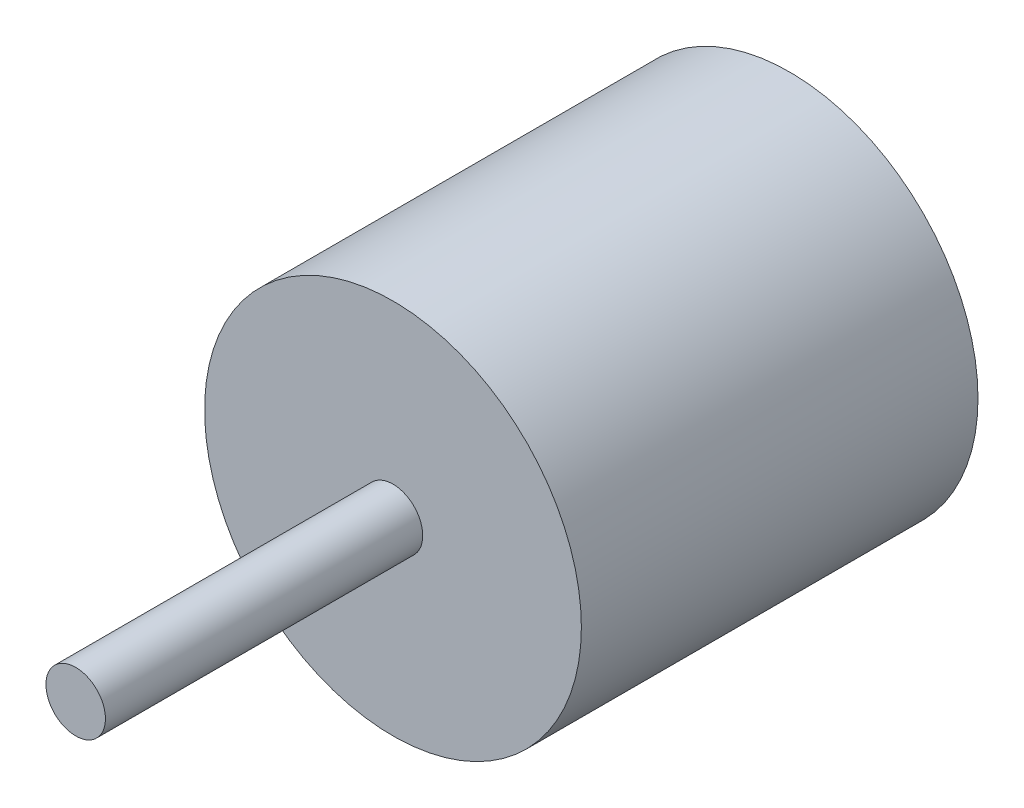
ISO-10303-21;
HEADER;
FILE_DESCRIPTION(('STEP AP214'),'2;1');
FILE_NAME('part.step','',(''),(''),'','','');
FILE_SCHEMA(('AUTOMOTIVE_DESIGN { 1 0 10303 214 1 1 1 1 }'));
ENDSEC;
DATA;
#1=APPLICATION_CONTEXT('core data for automotive mechanical design processes');
#2=APPLICATION_PROTOCOL_DEFINITION('international standard','automotive_design',2000,#1);
#3=PRODUCT_CONTEXT('',#1,'mechanical');
#4=PRODUCT('Part','Part','',(#3));
#5=PRODUCT_RELATED_PRODUCT_CATEGORY('part','',(#4));
#6=PRODUCT_DEFINITION_FORMATION('','',#4);
#7=PRODUCT_DEFINITION_CONTEXT('part definition',#1,'design');
#8=PRODUCT_DEFINITION('design','',#6,#7);
#9=PRODUCT_DEFINITION_SHAPE('','',#8);
#10=(LENGTH_UNIT() NAMED_UNIT(*) SI_UNIT(.MILLI.,.METRE.));
#11=(NAMED_UNIT(*) PLANE_ANGLE_UNIT() SI_UNIT($,.RADIAN.));
#12=(NAMED_UNIT(*) SI_UNIT($,.STERADIAN.) SOLID_ANGLE_UNIT());
#13=UNCERTAINTY_MEASURE_WITH_UNIT(LENGTH_MEASURE(1.E-05),#10,'distance_accuracy_value','');
#14=(GEOMETRIC_REPRESENTATION_CONTEXT(3) GLOBAL_UNCERTAINTY_ASSIGNED_CONTEXT((#13)) GLOBAL_UNIT_ASSIGNED_CONTEXT((#10,
#11,#12)) REPRESENTATION_CONTEXT('',''));
#15=CARTESIAN_POINT('',(0.,0.,0.));
#16=DIRECTION('',(0.,0.,1.));
#17=DIRECTION('',(1.,0.,0.));
#18=AXIS2_PLACEMENT_3D('',#15,#16,#17);
#19=CARTESIAN_POINT('',(26.38722035816,15.3807861980718,40.));
#20=DIRECTION('',(0.,0.,-1.));
#21=DIRECTION('',(-1.,0.,0.));
#22=AXIS2_PLACEMENT_3D('',#19,#20,#21);
#23=CYLINDRICAL_SURFACE('',#22,19.);
#24=CARTESIAN_POINT('',(26.38722035816,15.3807861980718,40.));
#25=DIRECTION('',(0.,0.,1.));
#26=DIRECTION('',(1.,0.,0.));
#27=AXIS2_PLACEMENT_3D('',#24,#25,#26);
#28=CIRCLE('',#27,19.);
#29=CARTESIAN_POINT('',(45.38722035816,15.3807861980718,40.));
#30=VERTEX_POINT('',#29);
#31=EDGE_CURVE('E45',#30,#30,#28,.T.);
#32=ORIENTED_EDGE('',*,*,#31,.F.);
#33=EDGE_LOOP('',(#32));
#34=FACE_BOUND('',#33,.T.);
#35=CARTESIAN_POINT('',(26.38722035816,15.3807861980718,0.));
#36=DIRECTION('',(0.,0.,1.));
#37=DIRECTION('',(1.,0.,0.));
#38=AXIS2_PLACEMENT_3D('',#35,#36,#37);
#39=CIRCLE('',#38,19.);
#40=CARTESIAN_POINT('',(45.38722035816,15.3807861980718,0.));
#41=VERTEX_POINT('',#40);
#42=EDGE_CURVE('E41',#41,#41,#39,.T.);
#43=ORIENTED_EDGE('',*,*,#42,.T.);
#44=EDGE_LOOP('',(#43));
#45=FACE_BOUND('',#44,.T.);
#46=ADVANCED_FACE('F38',(#34,#45),#23,.T.);
#47=CARTESIAN_POINT('',(26.38722035816,15.3807861980718,40.));
#48=DIRECTION('',(0.,0.,1.));
#49=DIRECTION('',(1.,0.,0.));
#50=AXIS2_PLACEMENT_3D('',#47,#48,#49);
#51=PLANE('',#50);
#52=CARTESIAN_POINT('',(26.38722035816,15.3807861980718,40.));
#53=DIRECTION('',(0.,0.,1.));
#54=DIRECTION('',(1.,0.,0.));
#55=AXIS2_PLACEMENT_3D('',#52,#53,#54);
#56=CIRCLE('',#55,3.);
#57=CARTESIAN_POINT('',(29.38722035816,15.3807861980718,40.));
#58=VERTEX_POINT('',#57);
#59=EDGE_CURVE('E10',#58,#58,#56,.T.);
#60=ORIENTED_EDGE('',*,*,#59,.F.);
#61=EDGE_LOOP('',(#60));
#62=FACE_BOUND('',#61,.T.);
#63=ORIENTED_EDGE('',*,*,#31,.T.);
#64=EDGE_LOOP('',(#63));
#65=FACE_BOUND('',#64,.T.);
#66=ADVANCED_FACE('F62',(#62,#65),#51,.T.);
#67=CARTESIAN_POINT('',(26.38722035816,15.3807861980718,0.));
#68=DIRECTION('',(0.,0.,1.));
#69=DIRECTION('',(1.,0.,0.));
#70=AXIS2_PLACEMENT_3D('',#67,#68,#69);
#71=PLANE('',#70);
#72=ORIENTED_EDGE('',*,*,#42,.F.);
#73=EDGE_LOOP('',(#72));
#74=FACE_BOUND('',#73,.T.);
#75=ADVANCED_FACE('F59',(#74),#71,.F.);
#76=CARTESIAN_POINT('',(26.38722035816,15.3807861980718,72.));
#77=DIRECTION('',(0.,0.,-1.));
#78=DIRECTION('',(-1.,0.,0.));
#79=AXIS2_PLACEMENT_3D('',#76,#77,#78);
#80=CYLINDRICAL_SURFACE('',#79,3.);
#81=CARTESIAN_POINT('',(26.38722035816,15.3807861980718,72.));
#82=DIRECTION('',(0.,0.,1.));
#83=DIRECTION('',(1.,0.,0.));
#84=AXIS2_PLACEMENT_3D('',#81,#82,#83);
#85=CIRCLE('',#84,3.);
#86=CARTESIAN_POINT('',(29.38722035816,15.3807861980718,72.));
#87=VERTEX_POINT('',#86);
#88=EDGE_CURVE('E51',#87,#87,#85,.T.);
#89=ORIENTED_EDGE('',*,*,#88,.F.);
#90=EDGE_LOOP('',(#89));
#91=FACE_BOUND('',#90,.T.);
#92=ORIENTED_EDGE('',*,*,#59,.T.);
#93=EDGE_LOOP('',(#92));
#94=FACE_BOUND('',#93,.T.);
#95=ADVANCED_FACE('F61',(#91,#94),#80,.T.);
#96=CARTESIAN_POINT('',(26.38722035816,15.3807861980718,72.));
#97=DIRECTION('',(0.,0.,1.));
#98=DIRECTION('',(1.,0.,0.));
#99=AXIS2_PLACEMENT_3D('',#96,#97,#98);
#100=PLANE('',#99);
#101=ORIENTED_EDGE('',*,*,#88,.T.);
#102=EDGE_LOOP('',(#101));
#103=FACE_BOUND('',#102,.T.);
#104=ADVANCED_FACE('F67',(#103),#100,.T.);
#105=CLOSED_SHELL('',(#46,#66,#75,#95,#104));
#106=MANIFOLD_SOLID_BREP('B2',#105);
#107=ADVANCED_BREP_SHAPE_REPRESENTATION('',(#18,#106),#14);
#108=SHAPE_DEFINITION_REPRESENTATION(#9,#107);
ENDSEC;
END-ISO-10303-21;
